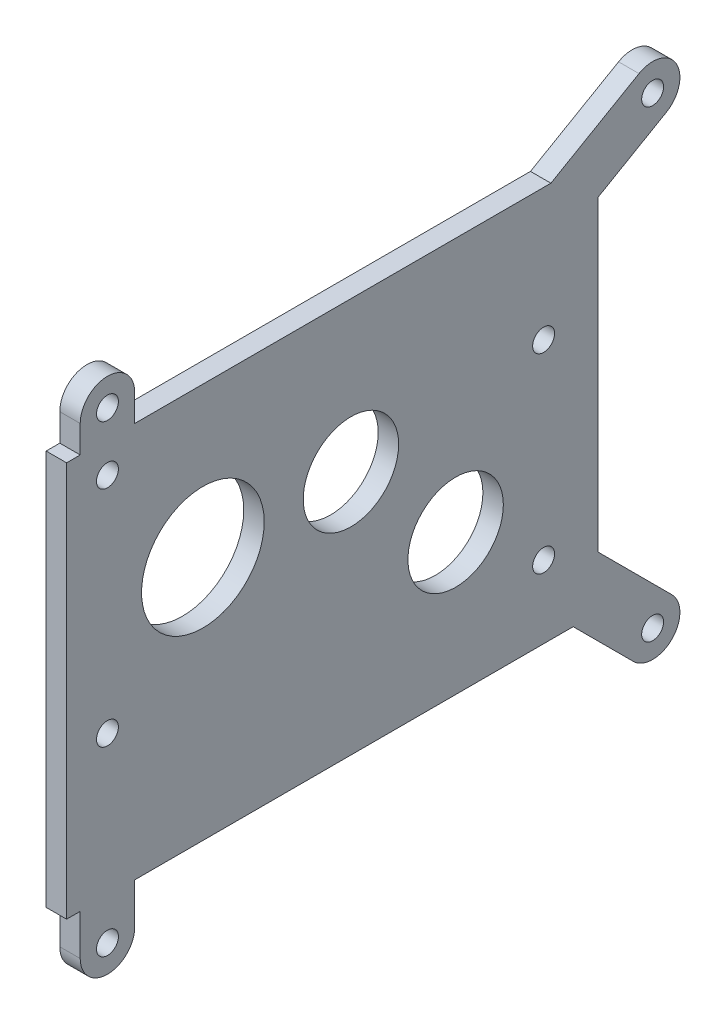
ISO-10303-21;
HEADER;
FILE_DESCRIPTION(('STEP AP214'),'2;1');
FILE_NAME('part.step','',(''),(''),'','','');
FILE_SCHEMA(('AUTOMOTIVE_DESIGN { 1 0 10303 214 1 1 1 1 }'));
ENDSEC;
DATA;
#1=APPLICATION_CONTEXT('core data for automotive mechanical design processes');
#2=APPLICATION_PROTOCOL_DEFINITION('international standard','automotive_design',2000,#1);
#3=PRODUCT_CONTEXT('',#1,'mechanical');
#4=PRODUCT('Part','Part','',(#3));
#5=PRODUCT_RELATED_PRODUCT_CATEGORY('part','',(#4));
#6=PRODUCT_DEFINITION_FORMATION('','',#4);
#7=PRODUCT_DEFINITION_CONTEXT('part definition',#1,'design');
#8=PRODUCT_DEFINITION('design','',#6,#7);
#9=PRODUCT_DEFINITION_SHAPE('','',#8);
#10=(LENGTH_UNIT() NAMED_UNIT(*) SI_UNIT(.MILLI.,.METRE.));
#11=(NAMED_UNIT(*) PLANE_ANGLE_UNIT() SI_UNIT($,.RADIAN.));
#12=(NAMED_UNIT(*) SI_UNIT($,.STERADIAN.) SOLID_ANGLE_UNIT());
#13=UNCERTAINTY_MEASURE_WITH_UNIT(LENGTH_MEASURE(1.E-05),#10,'distance_accuracy_value','');
#14=(GEOMETRIC_REPRESENTATION_CONTEXT(3) GLOBAL_UNCERTAINTY_ASSIGNED_CONTEXT((#13)) GLOBAL_UNIT_ASSIGNED_CONTEXT((#10,
#11,#12)) REPRESENTATION_CONTEXT('',''));
#15=CARTESIAN_POINT('',(0.,0.,0.));
#16=DIRECTION('',(0.,0.,1.));
#17=DIRECTION('',(1.,0.,0.));
#18=AXIS2_PLACEMENT_3D('',#15,#16,#17);
#19=CARTESIAN_POINT('',(4.7625,0.,0.));
#20=DIRECTION('',(0.,1.,0.));
#21=DIRECTION('',(0.,0.,1.));
#22=AXIS2_PLACEMENT_3D('',#19,#20,#21);
#23=PLANE('',#22);
#24=DIRECTION('',(0.,0.,-1.));
#25=VECTOR('',#24,1.);
#26=CARTESIAN_POINT('',(4.7625,0.,0.));
#27=LINE('',#26,#25);
#28=CARTESIAN_POINT('',(4.7625,0.,-15.8749999999987));
#29=VERTEX_POINT('',#28);
#30=CARTESIAN_POINT('',(4.7625,0.,-118.019743878927));
#31=VERTEX_POINT('',#30);
#32=EDGE_CURVE('E50',#29,#31,#27,.T.);
#33=ORIENTED_EDGE('',*,*,#32,.F.);
#34=DIRECTION('',(-1.,0.,0.));
#35=VECTOR('',#34,1.);
#36=CARTESIAN_POINT('',(42.2255353155841,0.,-15.8749999999987));
#37=LINE('',#36,#35);
#38=CARTESIAN_POINT('',(0.,0.,-15.8749999999987));
#39=VERTEX_POINT('',#38);
#40=EDGE_CURVE('E195',#29,#39,#37,.T.);
#41=ORIENTED_EDGE('',*,*,#40,.T.);
#42=DIRECTION('',(0.,0.,-1.));
#43=VECTOR('',#42,1.);
#44=CARTESIAN_POINT('',(0.,0.,0.));
#45=LINE('',#44,#43);
#46=CARTESIAN_POINT('',(0.,0.,-118.019743878927));
#47=VERTEX_POINT('',#46);
#48=EDGE_CURVE('E333',#39,#47,#45,.T.);
#49=ORIENTED_EDGE('',*,*,#48,.T.);
#50=DIRECTION('',(-1.,0.,0.));
#51=VECTOR('',#50,1.);
#52=CARTESIAN_POINT('',(42.2255353155841,0.,-118.019743878927));
#53=LINE('',#52,#51);
#54=EDGE_CURVE('E255',#31,#47,#53,.T.);
#55=ORIENTED_EDGE('',*,*,#54,.F.);
#56=EDGE_LOOP('',(#33,#41,#49,#55));
#57=FACE_BOUND('',#56,.T.);
#58=ADVANCED_FACE('F35',(#57),#23,.F.);
#59=CARTESIAN_POINT('',(4.7625,92.075,0.));
#60=DIRECTION('',(0.,-1.,0.));
#61=DIRECTION('',(0.,0.,-1.));
#62=AXIS2_PLACEMENT_3D('',#59,#60,#61);
#63=PLANE('',#62);
#64=DIRECTION('',(0.,0.,1.));
#65=VECTOR('',#64,1.);
#66=CARTESIAN_POINT('',(4.7625,92.075,0.));
#67=LINE('',#66,#65);
#68=CARTESIAN_POINT('',(4.7625,92.075,-112.82647737194));
#69=VERTEX_POINT('',#68);
#70=CARTESIAN_POINT('',(4.7625,92.075,-15.8749999999987));
#71=VERTEX_POINT('',#70);
#72=EDGE_CURVE('E329',#69,#71,#67,.T.);
#73=ORIENTED_EDGE('',*,*,#72,.F.);
#74=DIRECTION('',(-1.,0.,0.));
#75=VECTOR('',#74,1.);
#76=CARTESIAN_POINT('',(42.2255353155841,92.075,-112.82647737194));
#77=LINE('',#76,#75);
#78=CARTESIAN_POINT('',(0.,92.075,-112.82647737194));
#79=VERTEX_POINT('',#78);
#80=EDGE_CURVE('E218',#69,#79,#77,.T.);
#81=ORIENTED_EDGE('',*,*,#80,.T.);
#82=DIRECTION('',(0.,0.,1.));
#83=VECTOR('',#82,1.);
#84=CARTESIAN_POINT('',(0.,92.075,0.));
#85=LINE('',#84,#83);
#86=CARTESIAN_POINT('',(0.,92.075,-15.8749999999987));
#87=VERTEX_POINT('',#86);
#88=EDGE_CURVE('E322',#79,#87,#85,.T.);
#89=ORIENTED_EDGE('',*,*,#88,.T.);
#90=DIRECTION('',(-1.,0.,0.));
#91=VECTOR('',#90,1.);
#92=CARTESIAN_POINT('',(42.2255353155841,92.075,-15.8749999999987));
#93=LINE('',#92,#91);
#94=EDGE_CURVE('E245',#71,#87,#93,.T.);
#95=ORIENTED_EDGE('',*,*,#94,.F.);
#96=EDGE_LOOP('',(#73,#81,#89,#95));
#97=FACE_BOUND('',#96,.T.);
#98=ADVANCED_FACE('F369',(#97),#63,.F.);
#99=CARTESIAN_POINT('',(4.7625,0.,0.));
#100=DIRECTION('',(0.,0.,-1.));
#101=DIRECTION('',(-1.,0.,0.));
#102=AXIS2_PLACEMENT_3D('',#99,#100,#101);
#103=PLANE('',#102);
#104=DIRECTION('',(0.,-1.,0.));
#105=VECTOR('',#104,1.);
#106=CARTESIAN_POINT('',(0.,0.,0.));
#107=LINE('',#106,#105);
#108=CARTESIAN_POINT('',(0.,92.075,0.));
#109=VERTEX_POINT('',#108);
#110=CARTESIAN_POINT('',(0.,0.,0.));
#111=VERTEX_POINT('',#110);
#112=EDGE_CURVE('E316',#109,#111,#107,.T.);
#113=ORIENTED_EDGE('',*,*,#112,.T.);
#114=DIRECTION('',(-1.,0.,0.));
#115=VECTOR('',#114,1.);
#116=CARTESIAN_POINT('',(4.7625,0.,0.));
#117=LINE('',#116,#115);
#118=CARTESIAN_POINT('',(4.7625,0.,0.));
#119=VERTEX_POINT('',#118);
#120=EDGE_CURVE('E11',#119,#111,#117,.T.);
#121=ORIENTED_EDGE('',*,*,#120,.F.);
#122=DIRECTION('',(0.,-1.,0.));
#123=VECTOR('',#122,1.);
#124=CARTESIAN_POINT('',(4.7625,0.,0.));
#125=LINE('',#124,#123);
#126=CARTESIAN_POINT('',(4.7625,92.075,0.));
#127=VERTEX_POINT('',#126);
#128=EDGE_CURVE('E319',#127,#119,#125,.T.);
#129=ORIENTED_EDGE('',*,*,#128,.F.);
#130=DIRECTION('',(-1.,0.,0.));
#131=VECTOR('',#130,1.);
#132=CARTESIAN_POINT('',(4.7625,92.075,0.));
#133=LINE('',#132,#131);
#134=EDGE_CURVE('E43',#127,#109,#133,.T.);
#135=ORIENTED_EDGE('',*,*,#134,.T.);
#136=EDGE_LOOP('',(#113,#121,#129,#135));
#137=FACE_BOUND('',#136,.T.);
#138=ADVANCED_FACE('F37',(#137),#103,.F.);
#139=CARTESIAN_POINT('',(0.,0.,-3.1749999999987));
#140=VERTEX_POINT('',#139);
#141=EDGE_CURVE('E334',#111,#140,#45,.T.);
#142=ORIENTED_EDGE('',*,*,#141,.T.);
#143=DIRECTION('',(-1.,0.,0.));
#144=VECTOR('',#143,1.);
#145=CARTESIAN_POINT('',(42.2255353155841,0.,-3.1749999999987));
#146=LINE('',#145,#144);
#147=CARTESIAN_POINT('',(4.7625,0.,-3.1749999999987));
#148=VERTEX_POINT('',#147);
#149=EDGE_CURVE('E58',#148,#140,#146,.T.);
#150=ORIENTED_EDGE('',*,*,#149,.F.);
#151=EDGE_CURVE('E323',#119,#148,#27,.T.);
#152=ORIENTED_EDGE('',*,*,#151,.F.);
#153=ORIENTED_EDGE('',*,*,#120,.T.);
#154=EDGE_LOOP('',(#142,#150,#152,#153));
#155=FACE_BOUND('',#154,.T.);
#156=ADVANCED_FACE('F348',(#155),#23,.F.);
#157=CARTESIAN_POINT('',(4.7625,0.,-123.825));
#158=DIRECTION('',(0.,0.,1.));
#159=DIRECTION('',(1.,0.,0.));
#160=AXIS2_PLACEMENT_3D('',#157,#158,#159);
#161=PLANE('',#160);
#162=DIRECTION('',(0.,1.,0.));
#163=VECTOR('',#162,1.);
#164=CARTESIAN_POINT('',(0.,0.,-123.825));
#165=LINE('',#164,#163);
#166=CARTESIAN_POINT('',(0.,12.1552561210658,-123.825));
#167=VERTEX_POINT('',#166);
#168=CARTESIAN_POINT('',(0.,83.7603031625821,-123.825));
#169=VERTEX_POINT('',#168);
#170=EDGE_CURVE('E336',#167,#169,#165,.T.);
#171=ORIENTED_EDGE('',*,*,#170,.T.);
#172=DIRECTION('',(-1.,0.,0.));
#173=VECTOR('',#172,1.);
#174=CARTESIAN_POINT('',(42.2255353155841,83.7603031625821,-123.825));
#175=LINE('',#174,#173);
#176=CARTESIAN_POINT('',(4.7625,83.7603031625821,-123.825));
#177=VERTEX_POINT('',#176);
#178=EDGE_CURVE('E220',#177,#169,#175,.T.);
#179=ORIENTED_EDGE('',*,*,#178,.F.);
#180=DIRECTION('',(0.,1.,0.));
#181=VECTOR('',#180,1.);
#182=CARTESIAN_POINT('',(4.7625,0.,-123.825));
#183=LINE('',#182,#181);
#184=CARTESIAN_POINT('',(4.7625,12.1552561210658,-123.825));
#185=VERTEX_POINT('',#184);
#186=EDGE_CURVE('E325',#185,#177,#183,.T.);
#187=ORIENTED_EDGE('',*,*,#186,.F.);
#188=DIRECTION('',(-1.,0.,0.));
#189=VECTOR('',#188,1.);
#190=CARTESIAN_POINT('',(42.2255353155841,12.1552561210658,-123.825));
#191=LINE('',#190,#189);
#192=EDGE_CURVE('E268',#185,#167,#191,.T.);
#193=ORIENTED_EDGE('',*,*,#192,.T.);
#194=EDGE_LOOP('',(#171,#179,#187,#193));
#195=FACE_BOUND('',#194,.T.);
#196=ADVANCED_FACE('F386',(#195),#161,.F.);
#197=CARTESIAN_POINT('',(4.7625,92.075,-3.1749999999987));
#198=VERTEX_POINT('',#197);
#199=EDGE_CURVE('E328',#198,#127,#67,.T.);
#200=ORIENTED_EDGE('',*,*,#199,.F.);
#201=DIRECTION('',(-1.,0.,0.));
#202=VECTOR('',#201,1.);
#203=CARTESIAN_POINT('',(42.2255353155841,92.075,-3.1749999999987));
#204=LINE('',#203,#202);
#205=CARTESIAN_POINT('',(0.,92.075,-3.1749999999987));
#206=VERTEX_POINT('',#205);
#207=EDGE_CURVE('E243',#198,#206,#204,.T.);
#208=ORIENTED_EDGE('',*,*,#207,.T.);
#209=EDGE_CURVE('E338',#206,#109,#85,.T.);
#210=ORIENTED_EDGE('',*,*,#209,.T.);
#211=ORIENTED_EDGE('',*,*,#134,.F.);
#212=EDGE_LOOP('',(#200,#208,#210,#211));
#213=FACE_BOUND('',#212,.T.);
#214=ADVANCED_FACE('F354',(#213),#63,.F.);
#215=CARTESIAN_POINT('',(4.7625,0.,0.));
#216=DIRECTION('',(-1.,0.,0.));
#217=DIRECTION('',(0.,0.,1.));
#218=AXIS2_PLACEMENT_3D('',#215,#216,#217);
#219=PLANE('',#218);
#220=CARTESIAN_POINT('',(4.7625,-9.525000000002,-136.524999999999));
#221=DIRECTION('',(-1.,0.,0.));
#222=DIRECTION('',(0.,0.,1.));
#223=AXIS2_PLACEMENT_3D('',#220,#221,#222);
#224=CIRCLE('',#223,2.5527);
#225=CARTESIAN_POINT('',(4.7625,-9.525000000002,-133.972299999999));
#226=VERTEX_POINT('',#225);
#227=EDGE_CURVE('E420',#226,#226,#224,.T.);
#228=ORIENTED_EDGE('',*,*,#227,.T.);
#229=EDGE_LOOP('',(#228));
#230=FACE_BOUND('',#229,.T.);
#231=CARTESIAN_POINT('',(4.7625,98.424999999998,-136.524999999999));
#232=DIRECTION('',(-1.,0.,0.));
#233=DIRECTION('',(0.,0.,1.));
#234=AXIS2_PLACEMENT_3D('',#231,#232,#233);
#235=CIRCLE('',#234,2.55270000000001);
#236=CARTESIAN_POINT('',(4.7625,98.424999999998,-133.972299999999));
#237=VERTEX_POINT('',#236);
#238=EDGE_CURVE('E414',#237,#237,#235,.T.);
#239=ORIENTED_EDGE('',*,*,#238,.T.);
#240=EDGE_LOOP('',(#239));
#241=FACE_BOUND('',#240,.T.);
#242=CARTESIAN_POINT('',(4.7625,98.424999999998,-9.5249999999987));
#243=DIRECTION('',(-1.,0.,0.));
#244=DIRECTION('',(0.,0.,1.));
#245=AXIS2_PLACEMENT_3D('',#242,#243,#244);
#246=CIRCLE('',#245,2.55270000000001);
#247=CARTESIAN_POINT('',(4.7625,98.424999999998,-6.9722999999987));
#248=VERTEX_POINT('',#247);
#249=EDGE_CURVE('E408',#248,#248,#246,.T.);
#250=ORIENTED_EDGE('',*,*,#249,.T.);
#251=EDGE_LOOP('',(#250));
#252=FACE_BOUND('',#251,.T.);
#253=CARTESIAN_POINT('',(4.7625,-9.525000000002,-9.5249999999987));
#254=DIRECTION('',(-1.,0.,0.));
#255=DIRECTION('',(0.,0.,1.));
#256=AXIS2_PLACEMENT_3D('',#253,#254,#255);
#257=CIRCLE('',#256,2.5527);
#258=CARTESIAN_POINT('',(4.7625,-9.525000000002,-6.9722999999987));
#259=VERTEX_POINT('',#258);
#260=EDGE_CURVE('E183',#259,#259,#257,.T.);
#261=ORIENTED_EDGE('',*,*,#260,.T.);
#262=EDGE_LOOP('',(#261));
#263=FACE_BOUND('',#262,.T.);
#264=DIRECTION('',(0.,-0.500000000000004,0.866025403784436));
#265=VECTOR('',#264,1.);
#266=CARTESIAN_POINT('',(4.7625,103.924261314029,-133.349999999999));
#267=LINE('',#266,#265);
#268=CARTESIAN_POINT('',(4.7625,103.924261314029,-133.349999999999));
#269=VERTEX_POINT('',#268);
#270=EDGE_CURVE('E201',#269,#69,#267,.T.);
#271=ORIENTED_EDGE('',*,*,#270,.T.);
#272=ORIENTED_EDGE('',*,*,#72,.T.);
#273=DIRECTION('',(0.,1.,0.));
#274=VECTOR('',#273,1.);
#275=CARTESIAN_POINT('',(4.7625,98.424999999998,-15.8749999999987));
#276=LINE('',#275,#274);
#277=CARTESIAN_POINT('',(4.7625,98.424999999998,-15.8749999999987));
#278=VERTEX_POINT('',#277);
#279=EDGE_CURVE('E232',#71,#278,#276,.T.);
#280=ORIENTED_EDGE('',*,*,#279,.T.);
#281=CARTESIAN_POINT('',(4.7625,98.424999999998,-9.5249999999987));
#282=DIRECTION('',(-1.,0.,0.));
#283=DIRECTION('',(0.,0.,1.));
#284=AXIS2_PLACEMENT_3D('',#281,#282,#283);
#285=CIRCLE('',#284,6.35);
#286=CARTESIAN_POINT('',(4.7625,98.424999999998,-3.1749999999987));
#287=VERTEX_POINT('',#286);
#288=EDGE_CURVE('E229',#278,#287,#285,.F.);
#289=ORIENTED_EDGE('',*,*,#288,.T.);
#290=DIRECTION('',(0.,-1.,0.));
#291=VECTOR('',#290,1.);
#292=CARTESIAN_POINT('',(4.7625,92.075,-3.1749999999987));
#293=LINE('',#292,#291);
#294=EDGE_CURVE('E226',#287,#198,#293,.T.);
#295=ORIENTED_EDGE('',*,*,#294,.T.);
#296=ORIENTED_EDGE('',*,*,#199,.T.);
#297=ORIENTED_EDGE('',*,*,#128,.T.);
#298=ORIENTED_EDGE('',*,*,#151,.T.);
#299=DIRECTION('',(0.,-1.,0.));
#300=VECTOR('',#299,1.);
#301=CARTESIAN_POINT('',(4.7625,-9.525000000002,-3.1749999999987));
#302=LINE('',#301,#300);
#303=CARTESIAN_POINT('',(4.7625,-9.525000000002,-3.1749999999987));
#304=VERTEX_POINT('',#303);
#305=EDGE_CURVE('E198',#148,#304,#302,.T.);
#306=ORIENTED_EDGE('',*,*,#305,.T.);
#307=CARTESIAN_POINT('',(4.7625,-9.525000000002,-9.5249999999987));
#308=DIRECTION('',(-1.,0.,0.));
#309=DIRECTION('',(0.,0.,1.));
#310=AXIS2_PLACEMENT_3D('',#307,#308,#309);
#311=CIRCLE('',#310,6.35);
#312=CARTESIAN_POINT('',(4.7625,-9.525000000002,-15.8749999999987));
#313=VERTEX_POINT('',#312);
#314=EDGE_CURVE('E169',#304,#313,#311,.F.);
#315=ORIENTED_EDGE('',*,*,#314,.T.);
#316=DIRECTION('',(0.,1.,0.));
#317=VECTOR('',#316,1.);
#318=CARTESIAN_POINT('',(4.7625,-9.525000000002,-15.8749999999987));
#319=LINE('',#318,#317);
#320=EDGE_CURVE('E194',#313,#29,#319,.T.);
#321=ORIENTED_EDGE('',*,*,#320,.T.);
#322=ORIENTED_EDGE('',*,*,#32,.T.);
#323=DIRECTION('',(0.,-0.707106781186546,-0.707106781186549));
#324=VECTOR('',#323,1.);
#325=CARTESIAN_POINT('',(4.7625,-14.0151280605366,-132.034871939464));
#326=LINE('',#325,#324);
#327=CARTESIAN_POINT('',(4.7625,-14.0151280605366,-132.034871939464));
#328=VERTEX_POINT('',#327);
#329=EDGE_CURVE('E257',#31,#328,#326,.T.);
#330=ORIENTED_EDGE('',*,*,#329,.T.);
#331=CARTESIAN_POINT('',(4.7625,-9.525000000002,-136.524999999999));
#332=DIRECTION('',(-1.,0.,0.));
#333=DIRECTION('',(0.,0.,1.));
#334=AXIS2_PLACEMENT_3D('',#331,#332,#333);
#335=CIRCLE('',#334,6.34999999999998);
#336=CARTESIAN_POINT('',(4.7625,-5.03487193946744,-141.015128060533));
#337=VERTEX_POINT('',#336);
#338=EDGE_CURVE('E254',#328,#337,#335,.F.);
#339=ORIENTED_EDGE('',*,*,#338,.T.);
#340=DIRECTION('',(0.,0.707106781186547,0.707106781186548));
#341=VECTOR('',#340,1.);
#342=CARTESIAN_POINT('',(4.7625,-5.03487193946744,-141.015128060533));
#343=LINE('',#342,#341);
#344=EDGE_CURVE('E251',#337,#185,#343,.T.);
#345=ORIENTED_EDGE('',*,*,#344,.T.);
#346=ORIENTED_EDGE('',*,*,#186,.T.);
#347=DIRECTION('',(0.,0.500000000000005,-0.866025403784436));
#348=VECTOR('',#347,1.);
#349=CARTESIAN_POINT('',(4.7625,92.9257386859668,-139.699999999999));
#350=LINE('',#349,#348);
#351=CARTESIAN_POINT('',(4.7625,92.9257386859668,-139.699999999999));
#352=VERTEX_POINT('',#351);
#353=EDGE_CURVE('E207',#177,#352,#350,.T.);
#354=ORIENTED_EDGE('',*,*,#353,.T.);
#355=CARTESIAN_POINT('',(4.7625,98.424999999998,-136.524999999999));
#356=DIRECTION('',(-1.,0.,0.));
#357=DIRECTION('',(0.,0.,1.));
#358=AXIS2_PLACEMENT_3D('',#355,#356,#357);
#359=CIRCLE('',#358,6.35);
#360=EDGE_CURVE('E204',#352,#269,#359,.F.);
#361=ORIENTED_EDGE('',*,*,#360,.T.);
#362=EDGE_LOOP('',(#271,#272,#280,#289,#295,#296,#297,#298,#306,#315,#321,#322,#330,#339,#345,
#346,#354,#361));
#363=FACE_BOUND('',#362,.T.);
#364=CARTESIAN_POINT('',(4.7625,57.149999999998,-31.7499999999987));
#365=DIRECTION('',(1.,0.,0.));
#366=DIRECTION('',(0.,0.,-1.));
#367=AXIS2_PLACEMENT_3D('',#364,#365,#366);
#368=CIRCLE('',#367,14.2875);
#369=CARTESIAN_POINT('',(4.7625,57.149999999998,-46.0374999999987));
#370=VERTEX_POINT('',#369);
#371=EDGE_CURVE('E282',#370,#370,#368,.T.);
#372=ORIENTED_EDGE('',*,*,#371,.F.);
#373=EDGE_LOOP('',(#372));
#374=FACE_BOUND('',#373,.T.);
#375=CARTESIAN_POINT('',(4.7625,84.8296243751776,-9.52499999999352));
#376=DIRECTION('',(1.,0.,0.));
#377=DIRECTION('',(0.,0.,-1.));
#378=AXIS2_PLACEMENT_3D('',#375,#376,#377);
#379=CIRCLE('',#378,2.55270000000001);
#380=CARTESIAN_POINT('',(4.7625,84.8296243751776,-12.0776999999935));
#381=VERTEX_POINT('',#380);
#382=EDGE_CURVE('E286',#381,#381,#379,.T.);
#383=ORIENTED_EDGE('',*,*,#382,.F.);
#384=EDGE_LOOP('',(#383));
#385=FACE_BOUND('',#384,.T.);
#386=CARTESIAN_POINT('',(4.7625,61.3346243751776,-111.124999999994));
#387=DIRECTION('',(1.,0.,0.));
#388=DIRECTION('',(0.,0.,-1.));
#389=AXIS2_PLACEMENT_3D('',#386,#387,#388);
#390=CIRCLE('',#389,2.55270000000001);
#391=CARTESIAN_POINT('',(4.7625,61.3346243751776,-113.677699999994));
#392=VERTEX_POINT('',#391);
#393=EDGE_CURVE('E294',#392,#392,#390,.T.);
#394=ORIENTED_EDGE('',*,*,#393,.F.);
#395=EDGE_LOOP('',(#394));
#396=FACE_BOUND('',#395,.T.);
#397=CARTESIAN_POINT('',(4.7625,32.7596243751776,-9.52499999999353));
#398=DIRECTION('',(1.,0.,0.));
#399=DIRECTION('',(0.,0.,-1.));
#400=AXIS2_PLACEMENT_3D('',#397,#398,#399);
#401=CIRCLE('',#400,2.5527);
#402=CARTESIAN_POINT('',(4.7625,32.7596243751776,-12.0776999999935));
#403=VERTEX_POINT('',#402);
#404=EDGE_CURVE('E300',#403,#403,#401,.T.);
#405=ORIENTED_EDGE('',*,*,#404,.F.);
#406=EDGE_LOOP('',(#405));
#407=FACE_BOUND('',#406,.T.);
#408=CARTESIAN_POINT('',(4.7625,16.8846243751775,-111.124999999994));
#409=DIRECTION('',(1.,0.,0.));
#410=DIRECTION('',(0.,0.,-1.));
#411=AXIS2_PLACEMENT_3D('',#408,#409,#410);
#412=CIRCLE('',#411,2.5527);
#413=CARTESIAN_POINT('',(4.7625,16.8846243751775,-113.677699999994));
#414=VERTEX_POINT('',#413);
#415=EDGE_CURVE('E306',#414,#414,#412,.T.);
#416=ORIENTED_EDGE('',*,*,#415,.F.);
#417=EDGE_LOOP('',(#416));
#418=FACE_BOUND('',#417,.T.);
#419=CARTESIAN_POINT('',(4.7625,57.149999999998,-66.2431999999987));
#420=DIRECTION('',(1.,0.,0.));
#421=DIRECTION('',(0.,0.,-1.));
#422=AXIS2_PLACEMENT_3D('',#419,#420,#421);
#423=CIRCLE('',#422,11.1125);
#424=CARTESIAN_POINT('',(4.7625,57.149999999998,-77.3556999999987));
#425=VERTEX_POINT('',#424);
#426=EDGE_CURVE('E312',#425,#425,#423,.T.);
#427=ORIENTED_EDGE('',*,*,#426,.F.);
#428=EDGE_LOOP('',(#427));
#429=FACE_BOUND('',#428,.T.);
#430=CARTESIAN_POINT('',(4.7625,32.7596243751742,-90.6335756248226));
#431=DIRECTION('',(1.,0.,0.));
#432=DIRECTION('',(0.,0.,-1.));
#433=AXIS2_PLACEMENT_3D('',#430,#431,#432);
#434=CIRCLE('',#433,11.1125);
#435=CARTESIAN_POINT('',(4.7625,32.7596243751742,-101.746075624823));
#436=VERTEX_POINT('',#435);
#437=EDGE_CURVE('E259',#436,#436,#434,.T.);
#438=ORIENTED_EDGE('',*,*,#437,.F.);
#439=EDGE_LOOP('',(#438));
#440=FACE_BOUND('',#439,.T.);
#441=ADVANCED_FACE('F350',(#230,#241,#252,#263,#363,#374,#385,#396,#407,#418,#429,#440),#219,.F.);
#442=CARTESIAN_POINT('',(0.,0.,0.));
#443=DIRECTION('',(-1.,0.,0.));
#444=DIRECTION('',(0.,0.,1.));
#445=AXIS2_PLACEMENT_3D('',#442,#443,#444);
#446=PLANE('',#445);
#447=CARTESIAN_POINT('',(0.,-9.525000000002,-136.524999999999));
#448=DIRECTION('',(-1.,0.,0.));
#449=DIRECTION('',(0.,0.,1.));
#450=AXIS2_PLACEMENT_3D('',#447,#448,#449);
#451=CIRCLE('',#450,2.55269999999999);
#452=CARTESIAN_POINT('',(0.,-9.525000000002,-133.972299999999));
#453=VERTEX_POINT('',#452);
#454=EDGE_CURVE('E423',#453,#453,#451,.T.);
#455=ORIENTED_EDGE('',*,*,#454,.F.);
#456=EDGE_LOOP('',(#455));
#457=FACE_BOUND('',#456,.T.);
#458=CARTESIAN_POINT('',(0.,98.424999999998,-136.524999999999));
#459=DIRECTION('',(-1.,0.,0.));
#460=DIRECTION('',(0.,0.,1.));
#461=AXIS2_PLACEMENT_3D('',#458,#459,#460);
#462=CIRCLE('',#461,2.55269999999999);
#463=CARTESIAN_POINT('',(0.,98.424999999998,-133.972299999999));
#464=VERTEX_POINT('',#463);
#465=EDGE_CURVE('E417',#464,#464,#462,.T.);
#466=ORIENTED_EDGE('',*,*,#465,.F.);
#467=EDGE_LOOP('',(#466));
#468=FACE_BOUND('',#467,.T.);
#469=CARTESIAN_POINT('',(0.,98.424999999998,-9.5249999999987));
#470=DIRECTION('',(-1.,0.,0.));
#471=DIRECTION('',(0.,0.,1.));
#472=AXIS2_PLACEMENT_3D('',#469,#470,#471);
#473=CIRCLE('',#472,2.55269999999999);
#474=CARTESIAN_POINT('',(0.,98.424999999998,-6.97229999999871));
#475=VERTEX_POINT('',#474);
#476=EDGE_CURVE('E411',#475,#475,#473,.T.);
#477=ORIENTED_EDGE('',*,*,#476,.F.);
#478=EDGE_LOOP('',(#477));
#479=FACE_BOUND('',#478,.T.);
#480=CARTESIAN_POINT('',(0.,-9.525000000002,-9.5249999999987));
#481=DIRECTION('',(-1.,0.,0.));
#482=DIRECTION('',(0.,0.,1.));
#483=AXIS2_PLACEMENT_3D('',#480,#481,#482);
#484=CIRCLE('',#483,2.55269999999999);
#485=CARTESIAN_POINT('',(0.,-9.525000000002,-6.97229999999871));
#486=VERTEX_POINT('',#485);
#487=EDGE_CURVE('E186',#486,#486,#484,.T.);
#488=ORIENTED_EDGE('',*,*,#487,.F.);
#489=EDGE_LOOP('',(#488));
#490=FACE_BOUND('',#489,.T.);
#491=ORIENTED_EDGE('',*,*,#88,.F.);
#492=DIRECTION('',(0.,0.500000000000004,-0.866025403784436));
#493=VECTOR('',#492,1.);
#494=CARTESIAN_POINT('',(0.,103.924261314029,-133.349999999999));
#495=LINE('',#494,#493);
#496=CARTESIAN_POINT('',(0.,103.924261314029,-133.349999999999));
#497=VERTEX_POINT('',#496);
#498=EDGE_CURVE('E213',#79,#497,#495,.T.);
#499=ORIENTED_EDGE('',*,*,#498,.T.);
#500=CARTESIAN_POINT('',(0.,98.424999999998,-136.524999999999));
#501=DIRECTION('',(-1.,0.,0.));
#502=DIRECTION('',(0.,0.,1.));
#503=AXIS2_PLACEMENT_3D('',#500,#501,#502);
#504=CIRCLE('',#503,6.35);
#505=CARTESIAN_POINT('',(0.,92.9257386859668,-139.699999999999));
#506=VERTEX_POINT('',#505);
#507=EDGE_CURVE('E200',#497,#506,#504,.T.);
#508=ORIENTED_EDGE('',*,*,#507,.T.);
#509=DIRECTION('',(0.,-0.500000000000005,0.866025403784436));
#510=VECTOR('',#509,1.);
#511=CARTESIAN_POINT('',(0.,92.9257386859668,-139.699999999999));
#512=LINE('',#511,#510);
#513=EDGE_CURVE('E210',#506,#169,#512,.T.);
#514=ORIENTED_EDGE('',*,*,#513,.T.);
#515=ORIENTED_EDGE('',*,*,#170,.F.);
#516=DIRECTION('',(0.,-0.707106781186547,-0.707106781186548));
#517=VECTOR('',#516,1.);
#518=CARTESIAN_POINT('',(0.,-5.03487193946744,-141.015128060533));
#519=LINE('',#518,#517);
#520=CARTESIAN_POINT('',(0.,-5.03487193946744,-141.015128060533));
#521=VERTEX_POINT('',#520);
#522=EDGE_CURVE('E250',#167,#521,#519,.T.);
#523=ORIENTED_EDGE('',*,*,#522,.T.);
#524=CARTESIAN_POINT('',(0.,-9.525000000002,-136.524999999999));
#525=DIRECTION('',(-1.,0.,0.));
#526=DIRECTION('',(0.,0.,1.));
#527=AXIS2_PLACEMENT_3D('',#524,#525,#526);
#528=CIRCLE('',#527,6.34999999999998);
#529=CARTESIAN_POINT('',(0.,-14.0151280605366,-132.034871939464));
#530=VERTEX_POINT('',#529);
#531=EDGE_CURVE('E262',#521,#530,#528,.T.);
#532=ORIENTED_EDGE('',*,*,#531,.T.);
#533=DIRECTION('',(0.,0.707106781186546,0.707106781186549));
#534=VECTOR('',#533,1.);
#535=CARTESIAN_POINT('',(0.,-14.0151280605366,-132.034871939464));
#536=LINE('',#535,#534);
#537=EDGE_CURVE('E265',#530,#47,#536,.T.);
#538=ORIENTED_EDGE('',*,*,#537,.T.);
#539=ORIENTED_EDGE('',*,*,#48,.F.);
#540=DIRECTION('',(0.,-1.,0.));
#541=VECTOR('',#540,1.);
#542=CARTESIAN_POINT('',(0.,-9.525000000002,-15.8749999999987));
#543=LINE('',#542,#541);
#544=CARTESIAN_POINT('',(0.,-9.525000000002,-15.8749999999987));
#545=VERTEX_POINT('',#544);
#546=EDGE_CURVE('E172',#39,#545,#543,.T.);
#547=ORIENTED_EDGE('',*,*,#546,.T.);
#548=CARTESIAN_POINT('',(0.,-9.525000000002,-9.5249999999987));
#549=DIRECTION('',(-1.,0.,0.));
#550=DIRECTION('',(0.,0.,1.));
#551=AXIS2_PLACEMENT_3D('',#548,#549,#550);
#552=CIRCLE('',#551,6.35);
#553=CARTESIAN_POINT('',(0.,-9.525000000002,-3.1749999999987));
#554=VERTEX_POINT('',#553);
#555=EDGE_CURVE('E167',#545,#554,#552,.T.);
#556=ORIENTED_EDGE('',*,*,#555,.T.);
#557=DIRECTION('',(0.,1.,0.));
#558=VECTOR('',#557,1.);
#559=CARTESIAN_POINT('',(0.,-9.525000000002,-3.1749999999987));
#560=LINE('',#559,#558);
#561=EDGE_CURVE('E175',#554,#140,#560,.T.);
#562=ORIENTED_EDGE('',*,*,#561,.T.);
#563=ORIENTED_EDGE('',*,*,#141,.F.);
#564=ORIENTED_EDGE('',*,*,#112,.F.);
#565=ORIENTED_EDGE('',*,*,#209,.F.);
#566=DIRECTION('',(0.,1.,0.));
#567=VECTOR('',#566,1.);
#568=CARTESIAN_POINT('',(0.,92.075,-3.1749999999987));
#569=LINE('',#568,#567);
#570=CARTESIAN_POINT('',(0.,98.424999999998,-3.1749999999987));
#571=VERTEX_POINT('',#570);
#572=EDGE_CURVE('E238',#206,#571,#569,.T.);
#573=ORIENTED_EDGE('',*,*,#572,.T.);
#574=CARTESIAN_POINT('',(0.,98.424999999998,-9.5249999999987));
#575=DIRECTION('',(-1.,0.,0.));
#576=DIRECTION('',(0.,0.,1.));
#577=AXIS2_PLACEMENT_3D('',#574,#575,#576);
#578=CIRCLE('',#577,6.35);
#579=CARTESIAN_POINT('',(0.,98.424999999998,-15.8749999999987));
#580=VERTEX_POINT('',#579);
#581=EDGE_CURVE('E225',#571,#580,#578,.T.);
#582=ORIENTED_EDGE('',*,*,#581,.T.);
#583=DIRECTION('',(0.,-1.,0.));
#584=VECTOR('',#583,1.);
#585=CARTESIAN_POINT('',(0.,98.424999999998,-15.8749999999987));
#586=LINE('',#585,#584);
#587=EDGE_CURVE('E235',#580,#87,#586,.T.);
#588=ORIENTED_EDGE('',*,*,#587,.T.);
#589=EDGE_LOOP('',(#491,#499,#508,#514,#515,#523,#532,#538,#539,#547,#556,#562,#563,#564,#565,
#573,#582,#588));
#590=FACE_BOUND('',#589,.T.);
#591=CARTESIAN_POINT('',(0.,57.149999999998,-31.7499999999987));
#592=DIRECTION('',(1.,0.,0.));
#593=DIRECTION('',(0.,0.,-1.));
#594=AXIS2_PLACEMENT_3D('',#591,#592,#593);
#595=CIRCLE('',#594,14.2875);
#596=CARTESIAN_POINT('',(0.,57.149999999998,-46.0374999999987));
#597=VERTEX_POINT('',#596);
#598=EDGE_CURVE('E283',#597,#597,#595,.T.);
#599=ORIENTED_EDGE('',*,*,#598,.T.);
#600=EDGE_LOOP('',(#599));
#601=FACE_BOUND('',#600,.T.);
#602=CARTESIAN_POINT('',(0.,84.8296243751776,-9.52499999999352));
#603=DIRECTION('',(1.,0.,0.));
#604=DIRECTION('',(0.,0.,-1.));
#605=AXIS2_PLACEMENT_3D('',#602,#603,#604);
#606=CIRCLE('',#605,2.55270000000001);
#607=CARTESIAN_POINT('',(0.,84.8296243751776,-12.0776999999935));
#608=VERTEX_POINT('',#607);
#609=EDGE_CURVE('E291',#608,#608,#606,.T.);
#610=ORIENTED_EDGE('',*,*,#609,.T.);
#611=EDGE_LOOP('',(#610));
#612=FACE_BOUND('',#611,.T.);
#613=CARTESIAN_POINT('',(0.,61.3346243751776,-111.124999999994));
#614=DIRECTION('',(1.,0.,0.));
#615=DIRECTION('',(0.,0.,-1.));
#616=AXIS2_PLACEMENT_3D('',#613,#614,#615);
#617=CIRCLE('',#616,2.55270000000001);
#618=CARTESIAN_POINT('',(0.,61.3346243751776,-113.677699999994));
#619=VERTEX_POINT('',#618);
#620=EDGE_CURVE('E297',#619,#619,#617,.T.);
#621=ORIENTED_EDGE('',*,*,#620,.T.);
#622=EDGE_LOOP('',(#621));
#623=FACE_BOUND('',#622,.T.);
#624=CARTESIAN_POINT('',(0.,32.7596243751776,-9.52499999999353));
#625=DIRECTION('',(1.,0.,0.));
#626=DIRECTION('',(0.,0.,-1.));
#627=AXIS2_PLACEMENT_3D('',#624,#625,#626);
#628=CIRCLE('',#627,2.5527);
#629=CARTESIAN_POINT('',(0.,32.7596243751776,-12.0776999999935));
#630=VERTEX_POINT('',#629);
#631=EDGE_CURVE('E303',#630,#630,#628,.T.);
#632=ORIENTED_EDGE('',*,*,#631,.T.);
#633=EDGE_LOOP('',(#632));
#634=FACE_BOUND('',#633,.T.);
#635=CARTESIAN_POINT('',(0.,16.8846243751775,-111.124999999994));
#636=DIRECTION('',(1.,0.,0.));
#637=DIRECTION('',(0.,0.,-1.));
#638=AXIS2_PLACEMENT_3D('',#635,#636,#637);
#639=CIRCLE('',#638,2.5527);
#640=CARTESIAN_POINT('',(0.,16.8846243751775,-113.677699999994));
#641=VERTEX_POINT('',#640);
#642=EDGE_CURVE('E309',#641,#641,#639,.T.);
#643=ORIENTED_EDGE('',*,*,#642,.T.);
#644=EDGE_LOOP('',(#643));
#645=FACE_BOUND('',#644,.T.);
#646=CARTESIAN_POINT('',(0.,57.149999999998,-66.2431999999987));
#647=DIRECTION('',(1.,0.,0.));
#648=DIRECTION('',(0.,0.,-1.));
#649=AXIS2_PLACEMENT_3D('',#646,#647,#648);
#650=CIRCLE('',#649,11.1125);
#651=CARTESIAN_POINT('',(0.,57.149999999998,-77.3556999999987));
#652=VERTEX_POINT('',#651);
#653=EDGE_CURVE('E313',#652,#652,#650,.T.);
#654=ORIENTED_EDGE('',*,*,#653,.T.);
#655=EDGE_LOOP('',(#654));
#656=FACE_BOUND('',#655,.T.);
#657=CARTESIAN_POINT('',(0.,32.7596243751742,-90.6335756248226));
#658=DIRECTION('',(-1.,0.,0.));
#659=DIRECTION('',(0.,0.,1.));
#660=AXIS2_PLACEMENT_3D('',#657,#658,#659);
#661=CIRCLE('',#660,11.1125);
#662=CARTESIAN_POINT('',(0.,32.7596243751742,-79.5210756248226));
#663=VERTEX_POINT('',#662);
#664=EDGE_CURVE('E279',#663,#663,#661,.F.);
#665=ORIENTED_EDGE('',*,*,#664,.T.);
#666=EDGE_LOOP('',(#665));
#667=FACE_BOUND('',#666,.T.);
#668=ADVANCED_FACE('F180',(#457,#468,#479,#490,#590,#601,#612,#623,#634,#645,#656,#667),#446,.T.);
#669=CARTESIAN_POINT('',(0.,57.149999999998,-66.2431999999987));
#670=DIRECTION('',(1.,0.,0.));
#671=DIRECTION('',(0.,0.,-1.));
#672=AXIS2_PLACEMENT_3D('',#669,#670,#671);
#673=CYLINDRICAL_SURFACE('',#672,11.1125);
#674=ORIENTED_EDGE('',*,*,#653,.F.);
#675=EDGE_LOOP('',(#674));
#676=FACE_BOUND('',#675,.T.);
#677=ORIENTED_EDGE('',*,*,#426,.T.);
#678=EDGE_LOOP('',(#677));
#679=FACE_BOUND('',#678,.T.);
#680=ADVANCED_FACE('F431',(#676,#679),#673,.F.);
#681=CARTESIAN_POINT('',(4.7625,16.8846243751775,-111.124999999994));
#682=DIRECTION('',(1.,0.,0.));
#683=DIRECTION('',(0.,0.,-1.));
#684=AXIS2_PLACEMENT_3D('',#681,#682,#683);
#685=CYLINDRICAL_SURFACE('',#684,2.5527);
#686=ORIENTED_EDGE('',*,*,#642,.F.);
#687=EDGE_LOOP('',(#686));
#688=FACE_BOUND('',#687,.T.);
#689=ORIENTED_EDGE('',*,*,#415,.T.);
#690=EDGE_LOOP('',(#689));
#691=FACE_BOUND('',#690,.T.);
#692=ADVANCED_FACE('F651',(#688,#691),#685,.F.);
#693=CARTESIAN_POINT('',(4.7625,32.7596243751776,-9.52499999999353));
#694=DIRECTION('',(1.,0.,0.));
#695=DIRECTION('',(0.,0.,-1.));
#696=AXIS2_PLACEMENT_3D('',#693,#694,#695);
#697=CYLINDRICAL_SURFACE('',#696,2.5527);
#698=ORIENTED_EDGE('',*,*,#631,.F.);
#699=EDGE_LOOP('',(#698));
#700=FACE_BOUND('',#699,.T.);
#701=ORIENTED_EDGE('',*,*,#404,.T.);
#702=EDGE_LOOP('',(#701));
#703=FACE_BOUND('',#702,.T.);
#704=ADVANCED_FACE('F659',(#700,#703),#697,.F.);
#705=CARTESIAN_POINT('',(4.7625,61.3346243751776,-111.124999999994));
#706=DIRECTION('',(1.,0.,0.));
#707=DIRECTION('',(0.,0.,-1.));
#708=AXIS2_PLACEMENT_3D('',#705,#706,#707);
#709=CYLINDRICAL_SURFACE('',#708,2.55270000000001);
#710=ORIENTED_EDGE('',*,*,#620,.F.);
#711=EDGE_LOOP('',(#710));
#712=FACE_BOUND('',#711,.T.);
#713=ORIENTED_EDGE('',*,*,#393,.T.);
#714=EDGE_LOOP('',(#713));
#715=FACE_BOUND('',#714,.T.);
#716=ADVANCED_FACE('F667',(#712,#715),#709,.F.);
#717=CARTESIAN_POINT('',(4.7625,84.8296243751776,-9.52499999999352));
#718=DIRECTION('',(1.,0.,0.));
#719=DIRECTION('',(0.,0.,-1.));
#720=AXIS2_PLACEMENT_3D('',#717,#718,#719);
#721=CYLINDRICAL_SURFACE('',#720,2.55270000000001);
#722=ORIENTED_EDGE('',*,*,#609,.F.);
#723=EDGE_LOOP('',(#722));
#724=FACE_BOUND('',#723,.T.);
#725=ORIENTED_EDGE('',*,*,#382,.T.);
#726=EDGE_LOOP('',(#725));
#727=FACE_BOUND('',#726,.T.);
#728=ADVANCED_FACE('F675',(#724,#727),#721,.F.);
#729=CARTESIAN_POINT('',(0.,57.149999999998,-31.7499999999987));
#730=DIRECTION('',(1.,0.,0.));
#731=DIRECTION('',(0.,0.,-1.));
#732=AXIS2_PLACEMENT_3D('',#729,#730,#731);
#733=CYLINDRICAL_SURFACE('',#732,14.2875);
#734=ORIENTED_EDGE('',*,*,#598,.F.);
#735=EDGE_LOOP('',(#734));
#736=FACE_BOUND('',#735,.T.);
#737=ORIENTED_EDGE('',*,*,#371,.T.);
#738=EDGE_LOOP('',(#737));
#739=FACE_BOUND('',#738,.T.);
#740=ADVANCED_FACE('F683',(#736,#739),#733,.F.);
#741=CARTESIAN_POINT('',(-40.4111525448112,32.7596243751742,-90.6335756248226));
#742=DIRECTION('',(1.,0.,0.));
#743=DIRECTION('',(0.,0.,-1.));
#744=AXIS2_PLACEMENT_3D('',#741,#742,#743);
#745=CYLINDRICAL_SURFACE('',#744,11.1125);
#746=ORIENTED_EDGE('',*,*,#437,.T.);
#747=EDGE_LOOP('',(#746));
#748=FACE_BOUND('',#747,.T.);
#749=ORIENTED_EDGE('',*,*,#664,.F.);
#750=EDGE_LOOP('',(#749));
#751=FACE_BOUND('',#750,.T.);
#752=ADVANCED_FACE('F505',(#748,#751),#745,.F.);
#753=CARTESIAN_POINT('',(42.2255353155841,-14.0151280605366,-132.034871939464));
#754=DIRECTION('',(0.,-0.707106781186549,0.707106781186546));
#755=DIRECTION('',(0.,-0.707106781186546,-0.707106781186549));
#756=AXIS2_PLACEMENT_3D('',#753,#754,#755);
#757=PLANE('',#756);
#758=ORIENTED_EDGE('',*,*,#329,.F.);
#759=ORIENTED_EDGE('',*,*,#54,.T.);
#760=ORIENTED_EDGE('',*,*,#537,.F.);
#761=DIRECTION('',(-1.,0.,0.));
#762=VECTOR('',#761,1.);
#763=CARTESIAN_POINT('',(42.2255353155841,-14.0151280605366,-132.034871939464));
#764=LINE('',#763,#762);
#765=EDGE_CURVE('E271',#328,#530,#764,.T.);
#766=ORIENTED_EDGE('',*,*,#765,.F.);
#767=EDGE_LOOP('',(#758,#759,#760,#766));
#768=FACE_BOUND('',#767,.T.);
#769=ADVANCED_FACE('F400',(#768),#757,.T.);
#770=CARTESIAN_POINT('',(42.2255353155841,-9.525000000002,-136.524999999999));
#771=DIRECTION('',(-1.,0.,0.));
#772=DIRECTION('',(0.,0.,1.));
#773=AXIS2_PLACEMENT_3D('',#770,#771,#772);
#774=CYLINDRICAL_SURFACE('',#773,6.34999999999998);
#775=ORIENTED_EDGE('',*,*,#338,.F.);
#776=ORIENTED_EDGE('',*,*,#765,.T.);
#777=ORIENTED_EDGE('',*,*,#531,.F.);
#778=DIRECTION('',(-1.,0.,0.));
#779=VECTOR('',#778,1.);
#780=CARTESIAN_POINT('',(42.2255353155841,-5.03487193946744,-141.015128060533));
#781=LINE('',#780,#779);
#782=EDGE_CURVE('E273',#337,#521,#781,.T.);
#783=ORIENTED_EDGE('',*,*,#782,.F.);
#784=EDGE_LOOP('',(#775,#776,#777,#783));
#785=FACE_BOUND('',#784,.T.);
#786=ADVANCED_FACE('F504',(#785),#774,.T.);
#787=CARTESIAN_POINT('',(42.2255353155841,-5.03487193946744,-141.015128060533));
#788=DIRECTION('',(0.,0.707106781186548,-0.707106781186547));
#789=DIRECTION('',(0.,0.707106781186547,0.707106781186548));
#790=AXIS2_PLACEMENT_3D('',#787,#788,#789);
#791=PLANE('',#790);
#792=ORIENTED_EDGE('',*,*,#344,.F.);
#793=ORIENTED_EDGE('',*,*,#782,.T.);
#794=ORIENTED_EDGE('',*,*,#522,.F.);
#795=ORIENTED_EDGE('',*,*,#192,.F.);
#796=EDGE_LOOP('',(#792,#793,#794,#795));
#797=FACE_BOUND('',#796,.T.);
#798=ADVANCED_FACE('F393',(#797),#791,.T.);
#799=CARTESIAN_POINT('',(42.2255353155841,98.424999999998,-9.5249999999987));
#800=DIRECTION('',(-1.,0.,0.));
#801=DIRECTION('',(0.,0.,1.));
#802=AXIS2_PLACEMENT_3D('',#799,#800,#801);
#803=CYLINDRICAL_SURFACE('',#802,6.35);
#804=ORIENTED_EDGE('',*,*,#288,.F.);
#805=DIRECTION('',(-1.,0.,0.));
#806=VECTOR('',#805,1.);
#807=CARTESIAN_POINT('',(42.2255353155841,98.424999999998,-15.8749999999987));
#808=LINE('',#807,#806);
#809=EDGE_CURVE('E241',#278,#580,#808,.T.);
#810=ORIENTED_EDGE('',*,*,#809,.T.);
#811=ORIENTED_EDGE('',*,*,#581,.F.);
#812=DIRECTION('',(-1.,0.,0.));
#813=VECTOR('',#812,1.);
#814=CARTESIAN_POINT('',(42.2255353155841,98.424999999998,-3.1749999999987));
#815=LINE('',#814,#813);
#816=EDGE_CURVE('E230',#287,#571,#815,.T.);
#817=ORIENTED_EDGE('',*,*,#816,.F.);
#818=EDGE_LOOP('',(#804,#810,#811,#817));
#819=FACE_BOUND('',#818,.T.);
#820=ADVANCED_FACE('F362',(#819),#803,.T.);
#821=CARTESIAN_POINT('',(42.2255353155841,92.075,-3.1749999999987));
#822=DIRECTION('',(0.,0.,1.));
#823=DIRECTION('',(0.,-1.,0.));
#824=AXIS2_PLACEMENT_3D('',#821,#822,#823);
#825=PLANE('',#824);
#826=ORIENTED_EDGE('',*,*,#294,.F.);
#827=ORIENTED_EDGE('',*,*,#816,.T.);
#828=ORIENTED_EDGE('',*,*,#572,.F.);
#829=ORIENTED_EDGE('',*,*,#207,.F.);
#830=EDGE_LOOP('',(#826,#827,#828,#829));
#831=FACE_BOUND('',#830,.T.);
#832=ADVANCED_FACE('F356',(#831),#825,.T.);
#833=CARTESIAN_POINT('',(42.2255353155841,98.424999999998,-15.8749999999987));
#834=DIRECTION('',(0.,0.,-1.));
#835=DIRECTION('',(-1.,0.,0.));
#836=AXIS2_PLACEMENT_3D('',#833,#834,#835);
#837=PLANE('',#836);
#838=ORIENTED_EDGE('',*,*,#279,.F.);
#839=ORIENTED_EDGE('',*,*,#94,.T.);
#840=ORIENTED_EDGE('',*,*,#587,.F.);
#841=ORIENTED_EDGE('',*,*,#809,.F.);
#842=EDGE_LOOP('',(#838,#839,#840,#841));
#843=FACE_BOUND('',#842,.T.);
#844=ADVANCED_FACE('F366',(#843),#837,.T.);
#845=CARTESIAN_POINT('',(42.2255353155841,98.424999999998,-136.524999999999));
#846=DIRECTION('',(-1.,0.,0.));
#847=DIRECTION('',(0.,0.,1.));
#848=AXIS2_PLACEMENT_3D('',#845,#846,#847);
#849=CYLINDRICAL_SURFACE('',#848,6.35);
#850=ORIENTED_EDGE('',*,*,#360,.F.);
#851=DIRECTION('',(-1.,0.,0.));
#852=VECTOR('',#851,1.);
#853=CARTESIAN_POINT('',(42.2255353155841,92.9257386859668,-139.699999999999));
#854=LINE('',#853,#852);
#855=EDGE_CURVE('E216',#352,#506,#854,.T.);
#856=ORIENTED_EDGE('',*,*,#855,.T.);
#857=ORIENTED_EDGE('',*,*,#507,.F.);
#858=DIRECTION('',(-1.,0.,0.));
#859=VECTOR('',#858,1.);
#860=CARTESIAN_POINT('',(42.2255353155841,103.924261314029,-133.349999999999));
#861=LINE('',#860,#859);
#862=EDGE_CURVE('E205',#269,#497,#861,.T.);
#863=ORIENTED_EDGE('',*,*,#862,.F.);
#864=EDGE_LOOP('',(#850,#856,#857,#863));
#865=FACE_BOUND('',#864,.T.);
#866=ADVANCED_FACE('F379',(#865),#849,.T.);
#867=CARTESIAN_POINT('',(42.2255353155841,103.924261314029,-133.349999999999));
#868=DIRECTION('',(0.,0.866025403784436,0.500000000000004));
#869=DIRECTION('',(0.,-0.500000000000004,0.866025403784436));
#870=AXIS2_PLACEMENT_3D('',#867,#868,#869);
#871=PLANE('',#870);
#872=ORIENTED_EDGE('',*,*,#270,.F.);
#873=ORIENTED_EDGE('',*,*,#862,.T.);
#874=ORIENTED_EDGE('',*,*,#498,.F.);
#875=ORIENTED_EDGE('',*,*,#80,.F.);
#876=EDGE_LOOP('',(#872,#873,#874,#875));
#877=FACE_BOUND('',#876,.T.);
#878=ADVANCED_FACE('F374',(#877),#871,.T.);
#879=CARTESIAN_POINT('',(42.2255353155841,92.9257386859668,-139.699999999999));
#880=DIRECTION('',(0.,-0.866025403784436,-0.500000000000004));
#881=DIRECTION('',(0.,0.500000000000005,-0.866025403784436));
#882=AXIS2_PLACEMENT_3D('',#879,#880,#881);
#883=PLANE('',#882);
#884=ORIENTED_EDGE('',*,*,#353,.F.);
#885=ORIENTED_EDGE('',*,*,#178,.T.);
#886=ORIENTED_EDGE('',*,*,#513,.F.);
#887=ORIENTED_EDGE('',*,*,#855,.F.);
#888=EDGE_LOOP('',(#884,#885,#886,#887));
#889=FACE_BOUND('',#888,.T.);
#890=ADVANCED_FACE('F384',(#889),#883,.T.);
#891=CARTESIAN_POINT('',(42.2255353155841,-9.525000000002,-9.5249999999987));
#892=DIRECTION('',(-1.,0.,0.));
#893=DIRECTION('',(0.,0.,1.));
#894=AXIS2_PLACEMENT_3D('',#891,#892,#893);
#895=CYLINDRICAL_SURFACE('',#894,6.35);
#896=ORIENTED_EDGE('',*,*,#314,.F.);
#897=DIRECTION('',(-1.,0.,0.));
#898=VECTOR('',#897,1.);
#899=CARTESIAN_POINT('',(42.2255353155841,-9.525000000002,-3.1749999999987));
#900=LINE('',#899,#898);
#901=EDGE_CURVE('E162',#304,#554,#900,.T.);
#902=ORIENTED_EDGE('',*,*,#901,.T.);
#903=ORIENTED_EDGE('',*,*,#555,.F.);
#904=DIRECTION('',(-1.,0.,0.));
#905=VECTOR('',#904,1.);
#906=CARTESIAN_POINT('',(42.2255353155841,-9.525000000002,-15.8749999999987));
#907=LINE('',#906,#905);
#908=EDGE_CURVE('E192',#313,#545,#907,.T.);
#909=ORIENTED_EDGE('',*,*,#908,.F.);
#910=EDGE_LOOP('',(#896,#902,#903,#909));
#911=FACE_BOUND('',#910,.T.);
#912=ADVANCED_FACE('F164',(#911),#895,.T.);
#913=CARTESIAN_POINT('',(42.2255353155841,-9.525000000002,-15.8749999999987));
#914=DIRECTION('',(0.,0.,-1.));
#915=DIRECTION('',(-1.,0.,0.));
#916=AXIS2_PLACEMENT_3D('',#913,#914,#915);
#917=PLANE('',#916);
#918=ORIENTED_EDGE('',*,*,#320,.F.);
#919=ORIENTED_EDGE('',*,*,#908,.T.);
#920=ORIENTED_EDGE('',*,*,#546,.F.);
#921=ORIENTED_EDGE('',*,*,#40,.F.);
#922=EDGE_LOOP('',(#918,#919,#920,#921));
#923=FACE_BOUND('',#922,.T.);
#924=ADVANCED_FACE('F404',(#923),#917,.T.);
#925=CARTESIAN_POINT('',(42.2255353155841,-9.525000000002,-3.1749999999987));
#926=DIRECTION('',(0.,0.,1.));
#927=DIRECTION('',(1.,0.,0.));
#928=AXIS2_PLACEMENT_3D('',#925,#926,#927);
#929=PLANE('',#928);
#930=ORIENTED_EDGE('',*,*,#305,.F.);
#931=ORIENTED_EDGE('',*,*,#149,.T.);
#932=ORIENTED_EDGE('',*,*,#561,.F.);
#933=ORIENTED_EDGE('',*,*,#901,.F.);
#934=EDGE_LOOP('',(#930,#931,#932,#933));
#935=FACE_BOUND('',#934,.T.);
#936=ADVANCED_FACE('F176',(#935),#929,.T.);
#937=CARTESIAN_POINT('',(0.,-9.525000000002,-9.5249999999987));
#938=DIRECTION('',(-1.,0.,0.));
#939=DIRECTION('',(0.,0.,1.));
#940=AXIS2_PLACEMENT_3D('',#937,#938,#939);
#941=CYLINDRICAL_SURFACE('',#940,2.55269999999999);
#942=ORIENTED_EDGE('',*,*,#260,.F.);
#943=EDGE_LOOP('',(#942));
#944=FACE_BOUND('',#943,.T.);
#945=ORIENTED_EDGE('',*,*,#487,.T.);
#946=EDGE_LOOP('',(#945));
#947=FACE_BOUND('',#946,.T.);
#948=ADVANCED_FACE('F439',(#944,#947),#941,.F.);
#949=CARTESIAN_POINT('',(0.,98.424999999998,-9.5249999999987));
#950=DIRECTION('',(-1.,0.,0.));
#951=DIRECTION('',(0.,0.,1.));
#952=AXIS2_PLACEMENT_3D('',#949,#950,#951);
#953=CYLINDRICAL_SURFACE('',#952,2.5527);
#954=ORIENTED_EDGE('',*,*,#249,.F.);
#955=EDGE_LOOP('',(#954));
#956=FACE_BOUND('',#955,.T.);
#957=ORIENTED_EDGE('',*,*,#476,.T.);
#958=EDGE_LOOP('',(#957));
#959=FACE_BOUND('',#958,.T.);
#960=ADVANCED_FACE('F441',(#956,#959),#953,.F.);
#961=CARTESIAN_POINT('',(0.,98.424999999998,-136.524999999999));
#962=DIRECTION('',(-1.,0.,0.));
#963=DIRECTION('',(0.,0.,1.));
#964=AXIS2_PLACEMENT_3D('',#961,#962,#963);
#965=CYLINDRICAL_SURFACE('',#964,2.5527);
#966=ORIENTED_EDGE('',*,*,#238,.F.);
#967=EDGE_LOOP('',(#966));
#968=FACE_BOUND('',#967,.T.);
#969=ORIENTED_EDGE('',*,*,#465,.T.);
#970=EDGE_LOOP('',(#969));
#971=FACE_BOUND('',#970,.T.);
#972=ADVANCED_FACE('F448',(#968,#971),#965,.F.);
#973=CARTESIAN_POINT('',(0.,-9.525000000002,-136.524999999999));
#974=DIRECTION('',(-1.,0.,0.));
#975=DIRECTION('',(0.,0.,1.));
#976=AXIS2_PLACEMENT_3D('',#973,#974,#975);
#977=CYLINDRICAL_SURFACE('',#976,2.55269999999999);
#978=ORIENTED_EDGE('',*,*,#227,.F.);
#979=EDGE_LOOP('',(#978));
#980=FACE_BOUND('',#979,.T.);
#981=ORIENTED_EDGE('',*,*,#454,.T.);
#982=EDGE_LOOP('',(#981));
#983=FACE_BOUND('',#982,.T.);
#984=ADVANCED_FACE('F427',(#980,#983),#977,.F.);
#985=CLOSED_SHELL('',(#58,#98,#138,#156,#196,#214,#441,#668,#680,#692,#704,#716,#728,#740,#752,
#769,#786,#798,#820,#832,#844,#866,#878,#890,#912,#924,#936,#948,#960,#972,#984));
#986=MANIFOLD_SOLID_BREP('B2',#985);
#987=ADVANCED_BREP_SHAPE_REPRESENTATION('',(#18,#986),#14);
#988=SHAPE_DEFINITION_REPRESENTATION(#9,#987);
ENDSEC;
END-ISO-10303-21;
